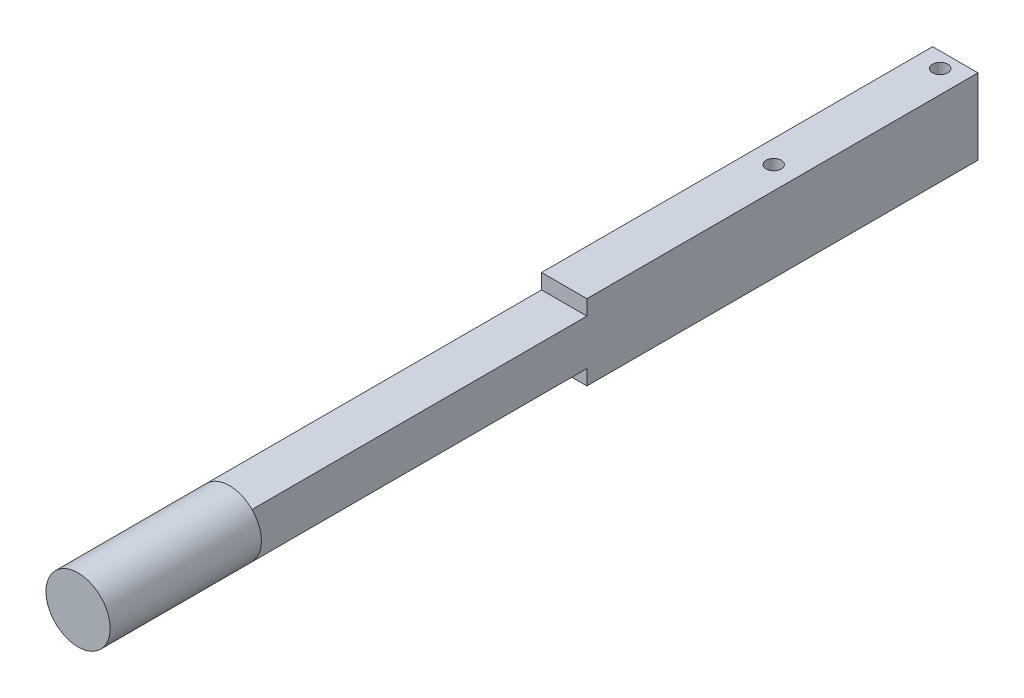
ISO-10303-21;
HEADER;
FILE_DESCRIPTION(('STEP AP214'),'2;1');
FILE_NAME('part.step','',(''),(''),'','','');
FILE_SCHEMA(('AUTOMOTIVE_DESIGN { 1 0 10303 214 1 1 1 1 }'));
ENDSEC;
DATA;
#1=APPLICATION_CONTEXT('core data for automotive mechanical design processes');
#2=APPLICATION_PROTOCOL_DEFINITION('international standard','automotive_design',2000,#1);
#3=PRODUCT_CONTEXT('',#1,'mechanical');
#4=PRODUCT('Part','Part','',(#3));
#5=PRODUCT_RELATED_PRODUCT_CATEGORY('part','',(#4));
#6=PRODUCT_DEFINITION_FORMATION('','',#4);
#7=PRODUCT_DEFINITION_CONTEXT('part definition',#1,'design');
#8=PRODUCT_DEFINITION('design','',#6,#7);
#9=PRODUCT_DEFINITION_SHAPE('','',#8);
#10=(LENGTH_UNIT() NAMED_UNIT(*) SI_UNIT(.MILLI.,.METRE.));
#11=(NAMED_UNIT(*) PLANE_ANGLE_UNIT() SI_UNIT($,.RADIAN.));
#12=(NAMED_UNIT(*) SI_UNIT($,.STERADIAN.) SOLID_ANGLE_UNIT());
#13=UNCERTAINTY_MEASURE_WITH_UNIT(LENGTH_MEASURE(1.E-05),#10,'distance_accuracy_value','');
#14=(GEOMETRIC_REPRESENTATION_CONTEXT(3) GLOBAL_UNCERTAINTY_ASSIGNED_CONTEXT((#13)) GLOBAL_UNIT_ASSIGNED_CONTEXT((#10,
#11,#12)) REPRESENTATION_CONTEXT('',''));
#15=CARTESIAN_POINT('',(0.,0.,0.));
#16=DIRECTION('',(0.,0.,1.));
#17=DIRECTION('',(1.,0.,0.));
#18=AXIS2_PLACEMENT_3D('',#15,#16,#17);
#19=CARTESIAN_POINT('',(19.05,19.05,609.6));
#20=DIRECTION('',(-1.,0.,0.));
#21=DIRECTION('',(0.,0.,1.));
#22=AXIS2_PLACEMENT_3D('',#19,#20,#21);
#23=PLANE('',#22);
#24=DIRECTION('',(0.,0.,-1.));
#25=VECTOR('',#24,1.);
#26=CARTESIAN_POINT('',(19.05,-19.05,609.6));
#27=LINE('',#26,#25);
#28=CARTESIAN_POINT('',(19.05,-19.05,609.6));
#29=VERTEX_POINT('',#28);
#30=CARTESIAN_POINT('',(19.05,-19.05,328.38334336773));
#31=VERTEX_POINT('',#30);
#32=EDGE_CURVE('E168',#29,#31,#27,.T.);
#33=ORIENTED_EDGE('',*,*,#32,.T.);
#34=DIRECTION('',(0.,-1.,0.));
#35=VECTOR('',#34,1.);
#36=CARTESIAN_POINT('',(19.05,31.75,328.38334336773));
#37=LINE('',#36,#35);
#38=CARTESIAN_POINT('',(19.05,-31.75,328.38334336773));
#39=VERTEX_POINT('',#38);
#40=EDGE_CURVE('E136',#31,#39,#37,.T.);
#41=ORIENTED_EDGE('',*,*,#40,.T.);
#42=DIRECTION('',(0.,0.,-1.));
#43=VECTOR('',#42,1.);
#44=CARTESIAN_POINT('',(19.05,-31.75,0.));
#45=LINE('',#44,#43);
#46=CARTESIAN_POINT('',(19.05,-31.75,0.));
#47=VERTEX_POINT('',#46);
#48=EDGE_CURVE('E119',#39,#47,#45,.T.);
#49=ORIENTED_EDGE('',*,*,#48,.T.);
#50=DIRECTION('',(0.,1.,0.));
#51=VECTOR('',#50,1.);
#52=CARTESIAN_POINT('',(19.05,19.05,0.));
#53=LINE('',#52,#51);
#54=CARTESIAN_POINT('',(19.05,31.75,0.));
#55=VERTEX_POINT('',#54);
#56=EDGE_CURVE('E151',#47,#55,#53,.T.);
#57=ORIENTED_EDGE('',*,*,#56,.T.);
#58=DIRECTION('',(0.,0.,1.));
#59=VECTOR('',#58,1.);
#60=CARTESIAN_POINT('',(19.05,31.75,0.));
#61=LINE('',#60,#59);
#62=CARTESIAN_POINT('',(19.05,31.75,328.38334336773));
#63=VERTEX_POINT('',#62);
#64=EDGE_CURVE('E111',#55,#63,#61,.T.);
#65=ORIENTED_EDGE('',*,*,#64,.T.);
#66=CARTESIAN_POINT('',(19.05,19.05,328.38334336773));
#67=VERTEX_POINT('',#66);
#68=EDGE_CURVE('E133',#63,#67,#37,.T.);
#69=ORIENTED_EDGE('',*,*,#68,.T.);
#70=DIRECTION('',(0.,0.,-1.));
#71=VECTOR('',#70,1.);
#72=CARTESIAN_POINT('',(19.05,19.05,609.6));
#73=LINE('',#72,#71);
#74=CARTESIAN_POINT('',(19.05,19.05,609.6));
#75=VERTEX_POINT('',#74);
#76=EDGE_CURVE('E48',#75,#67,#73,.T.);
#77=ORIENTED_EDGE('',*,*,#76,.F.);
#78=DIRECTION('',(0.,1.,0.));
#79=VECTOR('',#78,1.);
#80=CARTESIAN_POINT('',(19.05,19.05,609.6));
#81=LINE('',#80,#79);
#82=EDGE_CURVE('E156',#29,#75,#81,.T.);
#83=ORIENTED_EDGE('',*,*,#82,.F.);
#84=EDGE_LOOP('',(#33,#41,#49,#57,#65,#69,#77,#83));
#85=FACE_BOUND('',#84,.T.);
#86=ADVANCED_FACE('F40',(#85),#23,.F.);
#87=CARTESIAN_POINT('',(-19.05,19.05,609.6));
#88=DIRECTION('',(0.,-1.,0.));
#89=DIRECTION('',(0.,0.,-1.));
#90=AXIS2_PLACEMENT_3D('',#87,#88,#89);
#91=PLANE('',#90);
#92=ORIENTED_EDGE('',*,*,#76,.T.);
#93=DIRECTION('',(-1.,0.,0.));
#94=VECTOR('',#93,1.);
#95=CARTESIAN_POINT('',(-19.05,19.05,328.38334336773));
#96=LINE('',#95,#94);
#97=CARTESIAN_POINT('',(-19.05,19.05,328.38334336773));
#98=VERTEX_POINT('',#97);
#99=EDGE_CURVE('E58',#67,#98,#96,.T.);
#100=ORIENTED_EDGE('',*,*,#99,.T.);
#101=DIRECTION('',(0.,0.,-1.));
#102=VECTOR('',#101,1.);
#103=CARTESIAN_POINT('',(-19.05,19.05,609.6));
#104=LINE('',#103,#102);
#105=CARTESIAN_POINT('',(-19.05,19.05,609.6));
#106=VERTEX_POINT('',#105);
#107=EDGE_CURVE('E175',#106,#98,#104,.T.);
#108=ORIENTED_EDGE('',*,*,#107,.F.);
#109=DIRECTION('',(-1.,0.,0.));
#110=VECTOR('',#109,1.);
#111=CARTESIAN_POINT('',(-19.05,19.05,609.6));
#112=LINE('',#111,#110);
#113=EDGE_CURVE('E159',#75,#106,#112,.T.);
#114=ORIENTED_EDGE('',*,*,#113,.F.);
#115=EDGE_LOOP('',(#92,#100,#108,#114));
#116=FACE_BOUND('',#115,.T.);
#117=ADVANCED_FACE('F219',(#116),#91,.F.);
#118=CARTESIAN_POINT('',(-19.05,19.05,609.6));
#119=DIRECTION('',(1.,0.,0.));
#120=DIRECTION('',(0.,1.,0.));
#121=AXIS2_PLACEMENT_3D('',#118,#119,#120);
#122=PLANE('',#121);
#123=ORIENTED_EDGE('',*,*,#107,.T.);
#124=DIRECTION('',(0.,-1.,0.));
#125=VECTOR('',#124,1.);
#126=CARTESIAN_POINT('',(-19.05,31.75,328.38334336773));
#127=LINE('',#126,#125);
#128=CARTESIAN_POINT('',(-19.05,31.75,328.38334336773));
#129=VERTEX_POINT('',#128);
#130=EDGE_CURVE('E110',#129,#98,#127,.T.);
#131=ORIENTED_EDGE('',*,*,#130,.F.);
#132=DIRECTION('',(0.,0.,1.));
#133=VECTOR('',#132,1.);
#134=CARTESIAN_POINT('',(-19.05,31.75,0.));
#135=LINE('',#134,#133);
#136=CARTESIAN_POINT('',(-19.05,31.75,0.));
#137=VERTEX_POINT('',#136);
#138=EDGE_CURVE('E121',#137,#129,#135,.T.);
#139=ORIENTED_EDGE('',*,*,#138,.F.);
#140=DIRECTION('',(0.,-1.,0.));
#141=VECTOR('',#140,1.);
#142=CARTESIAN_POINT('',(-19.05,19.05,0.));
#143=LINE('',#142,#141);
#144=CARTESIAN_POINT('',(-19.05,-31.75,0.));
#145=VERTEX_POINT('',#144);
#146=EDGE_CURVE('E125',#137,#145,#143,.T.);
#147=ORIENTED_EDGE('',*,*,#146,.T.);
#148=DIRECTION('',(0.,0.,-1.));
#149=VECTOR('',#148,1.);
#150=CARTESIAN_POINT('',(-19.05,-31.75,0.));
#151=LINE('',#150,#149);
#152=CARTESIAN_POINT('',(-19.05,-31.75,328.38334336773));
#153=VERTEX_POINT('',#152);
#154=EDGE_CURVE('E117',#153,#145,#151,.T.);
#155=ORIENTED_EDGE('',*,*,#154,.F.);
#156=CARTESIAN_POINT('',(-19.05,-19.05,328.38334336773));
#157=VERTEX_POINT('',#156);
#158=EDGE_CURVE('E102',#157,#153,#127,.T.);
#159=ORIENTED_EDGE('',*,*,#158,.F.);
#160=DIRECTION('',(0.,0.,-1.));
#161=VECTOR('',#160,1.);
#162=CARTESIAN_POINT('',(-19.05,-19.05,609.6));
#163=LINE('',#162,#161);
#164=CARTESIAN_POINT('',(-19.05,-19.05,609.6));
#165=VERTEX_POINT('',#164);
#166=EDGE_CURVE('E173',#165,#157,#163,.T.);
#167=ORIENTED_EDGE('',*,*,#166,.F.);
#168=DIRECTION('',(0.,-1.,0.));
#169=VECTOR('',#168,1.);
#170=CARTESIAN_POINT('',(-19.05,19.05,609.6));
#171=LINE('',#170,#169);
#172=EDGE_CURVE('E162',#106,#165,#171,.T.);
#173=ORIENTED_EDGE('',*,*,#172,.F.);
#174=EDGE_LOOP('',(#123,#131,#139,#147,#155,#159,#167,#173));
#175=FACE_BOUND('',#174,.T.);
#176=ADVANCED_FACE('F123',(#175),#122,.F.);
#177=CARTESIAN_POINT('',(-19.05,-19.05,609.6));
#178=DIRECTION('',(0.,1.,0.));
#179=DIRECTION('',(0.,0.,1.));
#180=AXIS2_PLACEMENT_3D('',#177,#178,#179);
#181=PLANE('',#180);
#182=ORIENTED_EDGE('',*,*,#166,.T.);
#183=DIRECTION('',(1.,0.,0.));
#184=VECTOR('',#183,1.);
#185=CARTESIAN_POINT('',(-19.05,-19.05,328.38334336773));
#186=LINE('',#185,#184);
#187=EDGE_CURVE('E11',#157,#31,#186,.T.);
#188=ORIENTED_EDGE('',*,*,#187,.T.);
#189=ORIENTED_EDGE('',*,*,#32,.F.);
#190=DIRECTION('',(1.,0.,0.));
#191=VECTOR('',#190,1.);
#192=CARTESIAN_POINT('',(-19.05,-19.05,609.6));
#193=LINE('',#192,#191);
#194=EDGE_CURVE('E165',#165,#29,#193,.T.);
#195=ORIENTED_EDGE('',*,*,#194,.F.);
#196=EDGE_LOOP('',(#182,#188,#189,#195));
#197=FACE_BOUND('',#196,.T.);
#198=ADVANCED_FACE('F226',(#197),#181,.F.);
#199=CARTESIAN_POINT('',(0.,0.,0.));
#200=DIRECTION('',(0.,0.,1.));
#201=DIRECTION('',(1.,0.,0.));
#202=AXIS2_PLACEMENT_3D('',#199,#200,#201);
#203=PLANE('',#202);
#204=ORIENTED_EDGE('',*,*,#56,.F.);
#205=DIRECTION('',(1.,0.,0.));
#206=VECTOR('',#205,1.);
#207=CARTESIAN_POINT('',(-19.05,-31.75,0.));
#208=LINE('',#207,#206);
#209=EDGE_CURVE('E120',#145,#47,#208,.T.);
#210=ORIENTED_EDGE('',*,*,#209,.F.);
#211=ORIENTED_EDGE('',*,*,#146,.F.);
#212=DIRECTION('',(1.,0.,0.));
#213=VECTOR('',#212,1.);
#214=CARTESIAN_POINT('',(-19.05,31.75,0.));
#215=LINE('',#214,#213);
#216=EDGE_CURVE('E142',#137,#55,#215,.T.);
#217=ORIENTED_EDGE('',*,*,#216,.T.);
#218=EDGE_LOOP('',(#204,#210,#211,#217));
#219=FACE_BOUND('',#218,.T.);
#220=ADVANCED_FACE('F187',(#219),#203,.F.);
#221=CARTESIAN_POINT('',(0.,0.,609.6));
#222=DIRECTION('',(0.,0.,1.));
#223=DIRECTION('',(1.,0.,0.));
#224=AXIS2_PLACEMENT_3D('',#221,#222,#223);
#225=PLANE('',#224);
#226=CARTESIAN_POINT('',(0.,0.,609.6));
#227=DIRECTION('',(0.,0.,1.));
#228=DIRECTION('',(1.,0.,0.));
#229=AXIS2_PLACEMENT_3D('',#226,#227,#228);
#230=CIRCLE('',#229,26.9407683632075);
#231=EDGE_CURVE('E147',#29,#75,#230,.T.);
#232=ORIENTED_EDGE('',*,*,#231,.F.);
#233=ORIENTED_EDGE('',*,*,#82,.T.);
#234=EDGE_LOOP('',(#232,#233));
#235=FACE_BOUND('',#234,.T.);
#236=ADVANCED_FACE('F234',(#235),#225,.F.);
#237=EDGE_CURVE('E152',#75,#106,#230,.T.);
#238=ORIENTED_EDGE('',*,*,#237,.F.);
#239=ORIENTED_EDGE('',*,*,#113,.T.);
#240=EDGE_LOOP('',(#238,#239));
#241=FACE_BOUND('',#240,.T.);
#242=ADVANCED_FACE('F345',(#241),#225,.F.);
#243=EDGE_CURVE('E155',#106,#165,#230,.T.);
#244=ORIENTED_EDGE('',*,*,#243,.F.);
#245=ORIENTED_EDGE('',*,*,#172,.T.);
#246=EDGE_LOOP('',(#244,#245));
#247=FACE_BOUND('',#246,.T.);
#248=ADVANCED_FACE('F239',(#247),#225,.F.);
#249=CARTESIAN_POINT('',(0.,0.,736.6));
#250=DIRECTION('',(0.,0.,-1.));
#251=DIRECTION('',(-1.,0.,0.));
#252=AXIS2_PLACEMENT_3D('',#249,#250,#251);
#253=CYLINDRICAL_SURFACE('',#252,26.9407683632075);
#254=CARTESIAN_POINT('',(0.,0.,736.6));
#255=DIRECTION('',(0.,0.,1.));
#256=DIRECTION('',(1.,0.,0.));
#257=AXIS2_PLACEMENT_3D('',#254,#255,#256);
#258=CIRCLE('',#257,26.9407683632075);
#259=CARTESIAN_POINT('',(26.9407683632075,0.,736.6));
#260=VERTEX_POINT('',#259);
#261=EDGE_CURVE('E148',#260,#260,#258,.T.);
#262=ORIENTED_EDGE('',*,*,#261,.F.);
#263=EDGE_LOOP('',(#262));
#264=FACE_BOUND('',#263,.T.);
#265=ORIENTED_EDGE('',*,*,#237,.T.);
#266=ORIENTED_EDGE('',*,*,#243,.T.);
#267=EDGE_CURVE('E371',#165,#29,#230,.T.);
#268=ORIENTED_EDGE('',*,*,#267,.T.);
#269=ORIENTED_EDGE('',*,*,#231,.T.);
#270=EDGE_LOOP('',(#265,#266,#268,#269));
#271=FACE_BOUND('',#270,.T.);
#272=ADVANCED_FACE('F235',(#264,#271),#253,.T.);
#273=CARTESIAN_POINT('',(0.,0.,736.6));
#274=DIRECTION('',(0.,0.,1.));
#275=DIRECTION('',(1.,0.,0.));
#276=AXIS2_PLACEMENT_3D('',#273,#274,#275);
#277=PLANE('',#276);
#278=ORIENTED_EDGE('',*,*,#261,.T.);
#279=EDGE_LOOP('',(#278));
#280=FACE_BOUND('',#279,.T.);
#281=ADVANCED_FACE('F238',(#280),#277,.T.);
#282=ORIENTED_EDGE('',*,*,#267,.F.);
#283=ORIENTED_EDGE('',*,*,#194,.T.);
#284=EDGE_LOOP('',(#282,#283));
#285=FACE_BOUND('',#284,.T.);
#286=ADVANCED_FACE('F241',(#285),#225,.F.);
#287=CARTESIAN_POINT('',(-19.05,-31.75,0.));
#288=DIRECTION('',(0.,-1.,0.));
#289=DIRECTION('',(0.,0.,-1.));
#290=AXIS2_PLACEMENT_3D('',#287,#288,#289);
#291=PLANE('',#290);
#292=CARTESIAN_POINT('',(0.,-31.75,12.7));
#293=DIRECTION('',(0.,-1.,0.));
#294=DIRECTION('',(0.,0.,-1.));
#295=AXIS2_PLACEMENT_3D('',#292,#293,#294);
#296=CIRCLE('',#295,6.35);
#297=CARTESIAN_POINT('',(0.,-31.75,6.35));
#298=VERTEX_POINT('',#297);
#299=EDGE_CURVE('E198',#298,#298,#296,.T.);
#300=ORIENTED_EDGE('',*,*,#299,.F.);
#301=EDGE_LOOP('',(#300));
#302=FACE_BOUND('',#301,.T.);
#303=CARTESIAN_POINT('',(0.,-31.75,152.494180782412));
#304=DIRECTION('',(0.,-1.,0.));
#305=DIRECTION('',(0.,0.,-1.));
#306=AXIS2_PLACEMENT_3D('',#303,#304,#305);
#307=CIRCLE('',#306,6.35);
#308=CARTESIAN_POINT('',(0.,-31.75,146.144180782412));
#309=VERTEX_POINT('',#308);
#310=EDGE_CURVE('E192',#309,#309,#307,.T.);
#311=ORIENTED_EDGE('',*,*,#310,.F.);
#312=EDGE_LOOP('',(#311));
#313=FACE_BOUND('',#312,.T.);
#314=ORIENTED_EDGE('',*,*,#48,.F.);
#315=DIRECTION('',(1.,0.,0.));
#316=VECTOR('',#315,1.);
#317=CARTESIAN_POINT('',(-19.05,-31.75,328.38334336773));
#318=LINE('',#317,#316);
#319=EDGE_CURVE('E105',#153,#39,#318,.T.);
#320=ORIENTED_EDGE('',*,*,#319,.F.);
#321=ORIENTED_EDGE('',*,*,#154,.T.);
#322=ORIENTED_EDGE('',*,*,#209,.T.);
#323=EDGE_LOOP('',(#314,#320,#321,#322));
#324=FACE_BOUND('',#323,.T.);
#325=ADVANCED_FACE('F115',(#302,#313,#324),#291,.T.);
#326=CARTESIAN_POINT('',(-19.05,31.75,328.38334336773));
#327=DIRECTION('',(0.,0.,1.));
#328=DIRECTION('',(1.,0.,0.));
#329=AXIS2_PLACEMENT_3D('',#326,#327,#328);
#330=PLANE('',#329);
#331=ORIENTED_EDGE('',*,*,#187,.F.);
#332=ORIENTED_EDGE('',*,*,#158,.T.);
#333=ORIENTED_EDGE('',*,*,#319,.T.);
#334=ORIENTED_EDGE('',*,*,#40,.F.);
#335=EDGE_LOOP('',(#331,#332,#333,#334));
#336=FACE_BOUND('',#335,.T.);
#337=ADVANCED_FACE('F104',(#336),#330,.T.);
#338=ORIENTED_EDGE('',*,*,#99,.F.);
#339=ORIENTED_EDGE('',*,*,#68,.F.);
#340=DIRECTION('',(1.,0.,0.));
#341=VECTOR('',#340,1.);
#342=CARTESIAN_POINT('',(-19.05,31.75,328.38334336773));
#343=LINE('',#342,#341);
#344=EDGE_CURVE('E140',#129,#63,#343,.T.);
#345=ORIENTED_EDGE('',*,*,#344,.F.);
#346=ORIENTED_EDGE('',*,*,#130,.T.);
#347=EDGE_LOOP('',(#338,#339,#345,#346));
#348=FACE_BOUND('',#347,.T.);
#349=ADVANCED_FACE('F180',(#348),#330,.T.);
#350=CARTESIAN_POINT('',(-19.05,31.75,0.));
#351=DIRECTION('',(0.,1.,0.));
#352=DIRECTION('',(0.,0.,1.));
#353=AXIS2_PLACEMENT_3D('',#350,#351,#352);
#354=PLANE('',#353);
#355=CARTESIAN_POINT('',(0.,31.75,12.7));
#356=DIRECTION('',(0.,1.,0.));
#357=DIRECTION('',(0.,0.,1.));
#358=AXIS2_PLACEMENT_3D('',#355,#356,#357);
#359=CIRCLE('',#358,6.35);
#360=CARTESIAN_POINT('',(0.,31.75,19.05));
#361=VERTEX_POINT('',#360);
#362=EDGE_CURVE('E43',#361,#361,#359,.T.);
#363=ORIENTED_EDGE('',*,*,#362,.F.);
#364=EDGE_LOOP('',(#363));
#365=FACE_BOUND('',#364,.T.);
#366=CARTESIAN_POINT('',(0.,31.7500000000001,152.494180782412));
#367=DIRECTION('',(0.,-1.,0.));
#368=DIRECTION('',(0.,0.,-1.));
#369=AXIS2_PLACEMENT_3D('',#366,#367,#368);
#370=CIRCLE('',#369,6.35);
#371=CARTESIAN_POINT('',(0.,31.7500000000001,146.144180782412));
#372=VERTEX_POINT('',#371);
#373=EDGE_CURVE('E190',#372,#372,#370,.T.);
#374=ORIENTED_EDGE('',*,*,#373,.T.);
#375=EDGE_LOOP('',(#374));
#376=FACE_BOUND('',#375,.T.);
#377=ORIENTED_EDGE('',*,*,#64,.F.);
#378=ORIENTED_EDGE('',*,*,#216,.F.);
#379=ORIENTED_EDGE('',*,*,#138,.T.);
#380=ORIENTED_EDGE('',*,*,#344,.T.);
#381=EDGE_LOOP('',(#377,#378,#379,#380));
#382=FACE_BOUND('',#381,.T.);
#383=ADVANCED_FACE('F184',(#365,#376,#382),#354,.T.);
#384=CARTESIAN_POINT('',(0.,31.7500000000001,152.494180782412));
#385=DIRECTION('',(0.,-1.,0.));
#386=DIRECTION('',(0.,0.,-1.));
#387=AXIS2_PLACEMENT_3D('',#384,#385,#386);
#388=CYLINDRICAL_SURFACE('',#387,6.35);
#389=ORIENTED_EDGE('',*,*,#373,.F.);
#390=EDGE_LOOP('',(#389));
#391=FACE_BOUND('',#390,.T.);
#392=ORIENTED_EDGE('',*,*,#310,.T.);
#393=EDGE_LOOP('',(#392));
#394=FACE_BOUND('',#393,.T.);
#395=ADVANCED_FACE('F208',(#391,#394),#388,.F.);
#396=CARTESIAN_POINT('',(0.,501.65,12.7000000000001));
#397=DIRECTION('',(0.,-1.,0.));
#398=DIRECTION('',(0.,0.,-1.));
#399=AXIS2_PLACEMENT_3D('',#396,#397,#398);
#400=CYLINDRICAL_SURFACE('',#399,6.35);
#401=ORIENTED_EDGE('',*,*,#362,.T.);
#402=EDGE_LOOP('',(#401));
#403=FACE_BOUND('',#402,.T.);
#404=ORIENTED_EDGE('',*,*,#299,.T.);
#405=EDGE_LOOP('',(#404));
#406=FACE_BOUND('',#405,.T.);
#407=ADVANCED_FACE('F205',(#403,#406),#400,.F.);
#408=CLOSED_SHELL('',(#86,#117,#176,#198,#220,#236,#242,#248,#272,#281,#286,#325,#337,#349,#383,
#395,#407));
#409=MANIFOLD_SOLID_BREP('B2',#408);
#410=ADVANCED_BREP_SHAPE_REPRESENTATION('',(#18,#409),#14);
#411=SHAPE_DEFINITION_REPRESENTATION(#9,#410);
ENDSEC;
END-ISO-10303-21;
